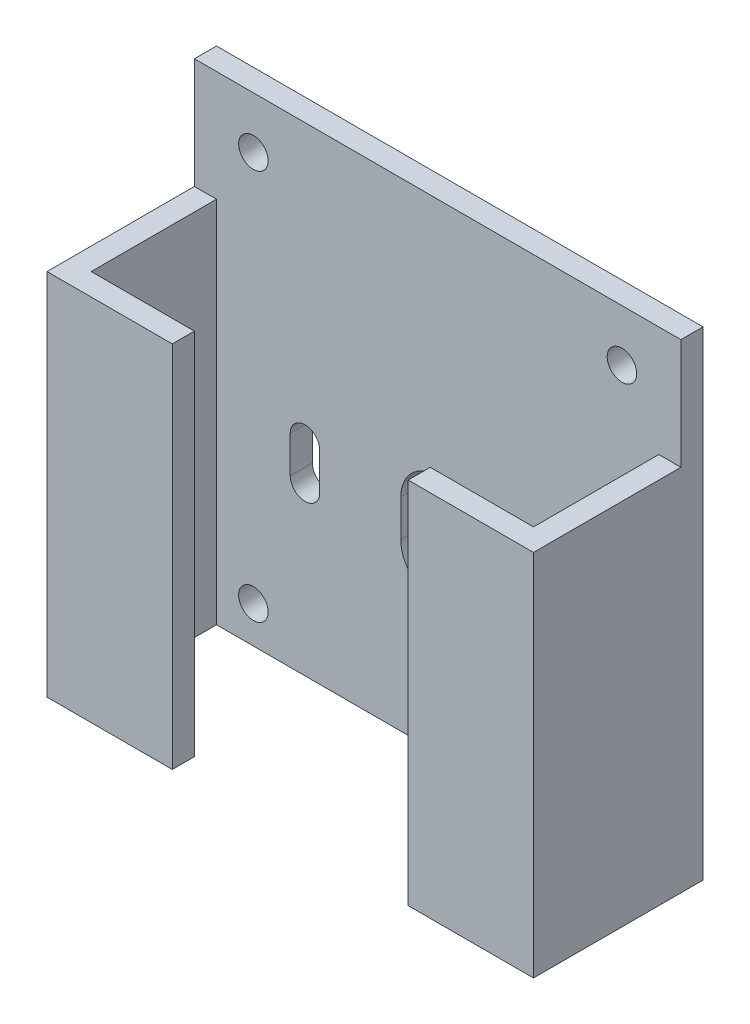
ISO-10303-21;
HEADER;
FILE_DESCRIPTION(('STEP AP214'),'2;1');
FILE_NAME('part.step','',(''),(''),'','','');
FILE_SCHEMA(('AUTOMOTIVE_DESIGN { 1 0 10303 214 1 1 1 1 }'));
ENDSEC;
DATA;
#1=APPLICATION_CONTEXT('core data for automotive mechanical design processes');
#2=APPLICATION_PROTOCOL_DEFINITION('international standard','automotive_design',2000,#1);
#3=PRODUCT_CONTEXT('',#1,'mechanical');
#4=PRODUCT('Part','Part','',(#3));
#5=PRODUCT_RELATED_PRODUCT_CATEGORY('part','',(#4));
#6=PRODUCT_DEFINITION_FORMATION('','',#4);
#7=PRODUCT_DEFINITION_CONTEXT('part definition',#1,'design');
#8=PRODUCT_DEFINITION('design','',#6,#7);
#9=PRODUCT_DEFINITION_SHAPE('','',#8);
#10=(LENGTH_UNIT() NAMED_UNIT(*) SI_UNIT(.MILLI.,.METRE.));
#11=(NAMED_UNIT(*) PLANE_ANGLE_UNIT() SI_UNIT($,.RADIAN.));
#12=(NAMED_UNIT(*) SI_UNIT($,.STERADIAN.) SOLID_ANGLE_UNIT());
#13=UNCERTAINTY_MEASURE_WITH_UNIT(LENGTH_MEASURE(1.E-05),#10,'distance_accuracy_value','');
#14=(GEOMETRIC_REPRESENTATION_CONTEXT(3) GLOBAL_UNCERTAINTY_ASSIGNED_CONTEXT((#13)) GLOBAL_UNIT_ASSIGNED_CONTEXT((#10,
#11,#12)) REPRESENTATION_CONTEXT('',''));
#15=CARTESIAN_POINT('',(0.,0.,0.));
#16=DIRECTION('',(0.,0.,1.));
#17=DIRECTION('',(1.,0.,0.));
#18=AXIS2_PLACEMENT_3D('',#15,#16,#17);
#19=CARTESIAN_POINT('',(-66.,-65.,23.));
#20=DIRECTION('',(0.,0.,1.));
#21=DIRECTION('',(1.,0.,0.));
#22=AXIS2_PLACEMENT_3D('',#19,#20,#21);
#23=PLANE('',#22);
#24=DIRECTION('',(1.,0.,0.));
#25=VECTOR('',#24,1.);
#26=CARTESIAN_POINT('',(-66.,-15.,23.));
#27=LINE('',#26,#25);
#28=CARTESIAN_POINT('',(-66.,-15.,23.));
#29=VERTEX_POINT('',#28);
#30=CARTESIAN_POINT('',(-49.,-15.,23.));
#31=VERTEX_POINT('',#30);
#32=EDGE_CURVE('E55',#29,#31,#27,.T.);
#33=ORIENTED_EDGE('',*,*,#32,.F.);
#34=DIRECTION('',(0.,-1.,0.));
#35=VECTOR('',#34,1.);
#36=CARTESIAN_POINT('',(-66.,-65.,23.));
#37=LINE('',#36,#35);
#38=CARTESIAN_POINT('',(-66.,-65.,23.));
#39=VERTEX_POINT('',#38);
#40=EDGE_CURVE('E217',#29,#39,#37,.T.);
#41=ORIENTED_EDGE('',*,*,#40,.T.);
#42=DIRECTION('',(1.,0.,0.));
#43=VECTOR('',#42,1.);
#44=CARTESIAN_POINT('',(-66.,-65.,23.));
#45=LINE('',#44,#43);
#46=CARTESIAN_POINT('',(-49.,-65.,23.));
#47=VERTEX_POINT('',#46);
#48=EDGE_CURVE('E254',#39,#47,#45,.T.);
#49=ORIENTED_EDGE('',*,*,#48,.T.);
#50=DIRECTION('',(0.,-1.,0.));
#51=VECTOR('',#50,1.);
#52=CARTESIAN_POINT('',(-49.,0.,23.));
#53=LINE('',#52,#51);
#54=EDGE_CURVE('E219',#31,#47,#53,.T.);
#55=ORIENTED_EDGE('',*,*,#54,.F.);
#56=EDGE_LOOP('',(#33,#41,#49,#55));
#57=FACE_BOUND('',#56,.T.);
#58=ADVANCED_FACE('F33',(#57),#23,.T.);
#59=CARTESIAN_POINT('',(-63.,-65.,20.));
#60=DIRECTION('',(0.,0.,1.));
#61=DIRECTION('',(1.,0.,0.));
#62=AXIS2_PLACEMENT_3D('',#59,#60,#61);
#63=PLANE('',#62);
#64=DIRECTION('',(0.,1.,0.));
#65=VECTOR('',#64,1.);
#66=CARTESIAN_POINT('',(-63.,-65.,20.));
#67=LINE('',#66,#65);
#68=CARTESIAN_POINT('',(-63.,-65.,20.));
#69=VERTEX_POINT('',#68);
#70=CARTESIAN_POINT('',(-63.,-15.,20.));
#71=VERTEX_POINT('',#70);
#72=EDGE_CURVE('E269',#69,#71,#67,.T.);
#73=ORIENTED_EDGE('',*,*,#72,.T.);
#74=DIRECTION('',(1.,0.,0.));
#75=VECTOR('',#74,1.);
#76=CARTESIAN_POINT('',(-63.,-15.,20.));
#77=LINE('',#76,#75);
#78=CARTESIAN_POINT('',(-49.,-15.,20.));
#79=VERTEX_POINT('',#78);
#80=EDGE_CURVE('E262',#71,#79,#77,.T.);
#81=ORIENTED_EDGE('',*,*,#80,.T.);
#82=DIRECTION('',(0.,1.,0.));
#83=VECTOR('',#82,1.);
#84=CARTESIAN_POINT('',(-49.,0.,20.));
#85=LINE('',#84,#83);
#86=CARTESIAN_POINT('',(-49.,-65.,20.));
#87=VERTEX_POINT('',#86);
#88=EDGE_CURVE('E260',#87,#79,#85,.T.);
#89=ORIENTED_EDGE('',*,*,#88,.F.);
#90=DIRECTION('',(1.,0.,0.));
#91=VECTOR('',#90,1.);
#92=CARTESIAN_POINT('',(-63.,-65.,20.));
#93=LINE('',#92,#91);
#94=EDGE_CURVE('E417',#69,#87,#93,.T.);
#95=ORIENTED_EDGE('',*,*,#94,.F.);
#96=EDGE_LOOP('',(#73,#81,#89,#95));
#97=FACE_BOUND('',#96,.T.);
#98=ADVANCED_FACE('F266',(#97),#63,.F.);
#99=CARTESIAN_POINT('',(-66.,0.,23.));
#100=DIRECTION('',(0.,1.,0.));
#101=DIRECTION('',(0.,0.,1.));
#102=AXIS2_PLACEMENT_3D('',#99,#100,#101);
#103=PLANE('',#102);
#104=DIRECTION('',(0.,0.,1.));
#105=VECTOR('',#104,1.);
#106=CARTESIAN_POINT('',(-66.,0.,23.));
#107=LINE('',#106,#105);
#108=CARTESIAN_POINT('',(-66.,0.,0.));
#109=VERTEX_POINT('',#108);
#110=CARTESIAN_POINT('',(-66.,0.,3.));
#111=VERTEX_POINT('',#110);
#112=EDGE_CURVE('E227',#109,#111,#107,.T.);
#113=ORIENTED_EDGE('',*,*,#112,.T.);
#114=DIRECTION('',(-1.,0.,0.));
#115=VECTOR('',#114,1.);
#116=CARTESIAN_POINT('',(-63.,0.,3.));
#117=LINE('',#116,#115);
#118=CARTESIAN_POINT('',(0.,0.,3.));
#119=VERTEX_POINT('',#118);
#120=EDGE_CURVE('E405',#119,#111,#117,.T.);
#121=ORIENTED_EDGE('',*,*,#120,.F.);
#122=DIRECTION('',(0.,0.,1.));
#123=VECTOR('',#122,1.);
#124=CARTESIAN_POINT('',(0.,0.,23.));
#125=LINE('',#124,#123);
#126=CARTESIAN_POINT('',(0.,0.,0.));
#127=VERTEX_POINT('',#126);
#128=EDGE_CURVE('E239',#127,#119,#125,.T.);
#129=ORIENTED_EDGE('',*,*,#128,.F.);
#130=DIRECTION('',(1.,0.,0.));
#131=VECTOR('',#130,1.);
#132=CARTESIAN_POINT('',(-66.,0.,0.));
#133=LINE('',#132,#131);
#134=EDGE_CURVE('E250',#109,#127,#133,.T.);
#135=ORIENTED_EDGE('',*,*,#134,.F.);
#136=EDGE_LOOP('',(#113,#121,#129,#135));
#137=FACE_BOUND('',#136,.T.);
#138=ADVANCED_FACE('F35',(#137),#103,.T.);
#139=CARTESIAN_POINT('',(-66.,0.,0.));
#140=DIRECTION('',(0.,0.,-1.));
#141=DIRECTION('',(-1.,0.,0.));
#142=AXIS2_PLACEMENT_3D('',#139,#140,#141);
#143=PLANE('',#142);
#144=CARTESIAN_POINT('',(-58.,-60.,0.));
#145=DIRECTION('',(0.,0.,-1.));
#146=DIRECTION('',(-1.,0.,0.));
#147=AXIS2_PLACEMENT_3D('',#144,#145,#146);
#148=CIRCLE('',#147,2.);
#149=CARTESIAN_POINT('',(-60.,-60.,0.));
#150=VERTEX_POINT('',#149);
#151=EDGE_CURVE('E383',#150,#150,#148,.T.);
#152=ORIENTED_EDGE('',*,*,#151,.F.);
#153=EDGE_LOOP('',(#152));
#154=FACE_BOUND('',#153,.T.);
#155=CARTESIAN_POINT('',(-8.,-60.,0.));
#156=DIRECTION('',(0.,0.,-1.));
#157=DIRECTION('',(-1.,0.,0.));
#158=AXIS2_PLACEMENT_3D('',#155,#156,#157);
#159=CIRCLE('',#158,2.);
#160=CARTESIAN_POINT('',(-10.,-60.,0.));
#161=VERTEX_POINT('',#160);
#162=EDGE_CURVE('E315',#161,#161,#159,.T.);
#163=ORIENTED_EDGE('',*,*,#162,.F.);
#164=EDGE_LOOP('',(#163));
#165=FACE_BOUND('',#164,.T.);
#166=CARTESIAN_POINT('',(-58.,-7.,0.));
#167=DIRECTION('',(0.,0.,-1.));
#168=DIRECTION('',(-1.,0.,0.));
#169=AXIS2_PLACEMENT_3D('',#166,#167,#168);
#170=CIRCLE('',#169,2.);
#171=CARTESIAN_POINT('',(-60.,-7.,0.));
#172=VERTEX_POINT('',#171);
#173=EDGE_CURVE('E346',#172,#172,#170,.T.);
#174=ORIENTED_EDGE('',*,*,#173,.F.);
#175=EDGE_LOOP('',(#174));
#176=FACE_BOUND('',#175,.T.);
#177=DIRECTION('',(0.,-1.,0.));
#178=VECTOR('',#177,1.);
#179=CARTESIAN_POINT('',(-13.,-37.5,0.));
#180=LINE('',#179,#178);
#181=CARTESIAN_POINT('',(-13.,-37.5,0.));
#182=VERTEX_POINT('',#181);
#183=CARTESIAN_POINT('',(-13.,-42.5,0.));
#184=VERTEX_POINT('',#183);
#185=EDGE_CURVE('E359',#182,#184,#180,.T.);
#186=ORIENTED_EDGE('',*,*,#185,.F.);
#187=CARTESIAN_POINT('',(-15.,-37.5,0.));
#188=DIRECTION('',(0.,0.,-1.));
#189=DIRECTION('',(-1.,0.,0.));
#190=AXIS2_PLACEMENT_3D('',#187,#188,#189);
#191=CIRCLE('',#190,2.);
#192=CARTESIAN_POINT('',(-17.,-37.5,0.));
#193=VERTEX_POINT('',#192);
#194=EDGE_CURVE('E362',#193,#182,#191,.T.);
#195=ORIENTED_EDGE('',*,*,#194,.F.);
#196=DIRECTION('',(0.,1.,0.));
#197=VECTOR('',#196,1.);
#198=CARTESIAN_POINT('',(-17.,-37.5,0.));
#199=LINE('',#198,#197);
#200=CARTESIAN_POINT('',(-17.,-42.5,0.));
#201=VERTEX_POINT('',#200);
#202=EDGE_CURVE('E353',#201,#193,#199,.T.);
#203=ORIENTED_EDGE('',*,*,#202,.F.);
#204=CARTESIAN_POINT('',(-15.,-42.5,0.));
#205=DIRECTION('',(0.,0.,-1.));
#206=DIRECTION('',(-1.,0.,0.));
#207=AXIS2_PLACEMENT_3D('',#204,#205,#206);
#208=CIRCLE('',#207,2.);
#209=EDGE_CURVE('E356',#184,#201,#208,.T.);
#210=ORIENTED_EDGE('',*,*,#209,.F.);
#211=EDGE_LOOP('',(#186,#195,#203,#210));
#212=FACE_BOUND('',#211,.T.);
#213=CARTESIAN_POINT('',(-33.,-37.5,0.));
#214=DIRECTION('',(0.,0.,-1.));
#215=DIRECTION('',(-1.,0.,0.));
#216=AXIS2_PLACEMENT_3D('',#213,#214,#215);
#217=CIRCLE('',#216,5.);
#218=CARTESIAN_POINT('',(-38.,-37.5,0.));
#219=VERTEX_POINT('',#218);
#220=CARTESIAN_POINT('',(-28.,-37.5,0.));
#221=VERTEX_POINT('',#220);
#222=EDGE_CURVE('E288',#219,#221,#217,.T.);
#223=ORIENTED_EDGE('',*,*,#222,.F.);
#224=DIRECTION('',(0.,1.,0.));
#225=VECTOR('',#224,1.);
#226=CARTESIAN_POINT('',(-38.,-37.5,0.));
#227=LINE('',#226,#225);
#228=CARTESIAN_POINT('',(-38.,-42.5,0.));
#229=VERTEX_POINT('',#228);
#230=EDGE_CURVE('E296',#229,#219,#227,.T.);
#231=ORIENTED_EDGE('',*,*,#230,.F.);
#232=CARTESIAN_POINT('',(-33.,-42.5,0.));
#233=DIRECTION('',(0.,0.,-1.));
#234=DIRECTION('',(-1.,0.,0.));
#235=AXIS2_PLACEMENT_3D('',#232,#233,#234);
#236=CIRCLE('',#235,5.);
#237=CARTESIAN_POINT('',(-28.,-42.5,0.));
#238=VERTEX_POINT('',#237);
#239=EDGE_CURVE('E293',#238,#229,#236,.T.);
#240=ORIENTED_EDGE('',*,*,#239,.F.);
#241=DIRECTION('',(0.,-1.,0.));
#242=VECTOR('',#241,1.);
#243=CARTESIAN_POINT('',(-28.,-37.5,0.));
#244=LINE('',#243,#242);
#245=EDGE_CURVE('E290',#221,#238,#244,.T.);
#246=ORIENTED_EDGE('',*,*,#245,.F.);
#247=EDGE_LOOP('',(#223,#231,#240,#246));
#248=FACE_BOUND('',#247,.T.);
#249=DIRECTION('',(0.,-1.,0.));
#250=VECTOR('',#249,1.);
#251=CARTESIAN_POINT('',(-49.,-37.5,0.));
#252=LINE('',#251,#250);
#253=CARTESIAN_POINT('',(-49.,-37.5,0.));
#254=VERTEX_POINT('',#253);
#255=CARTESIAN_POINT('',(-49.,-42.5,0.));
#256=VERTEX_POINT('',#255);
#257=EDGE_CURVE('E322',#254,#256,#252,.T.);
#258=ORIENTED_EDGE('',*,*,#257,.F.);
#259=CARTESIAN_POINT('',(-51.,-37.5,0.));
#260=DIRECTION('',(0.,0.,-1.));
#261=DIRECTION('',(-1.,0.,0.));
#262=AXIS2_PLACEMENT_3D('',#259,#260,#261);
#263=CIRCLE('',#262,2.00000000000001);
#264=CARTESIAN_POINT('',(-53.,-37.5,0.));
#265=VERTEX_POINT('',#264);
#266=EDGE_CURVE('E325',#265,#254,#263,.T.);
#267=ORIENTED_EDGE('',*,*,#266,.F.);
#268=DIRECTION('',(0.,1.,0.));
#269=VECTOR('',#268,1.);
#270=CARTESIAN_POINT('',(-53.,-37.5,0.));
#271=LINE('',#270,#269);
#272=CARTESIAN_POINT('',(-53.,-42.5,0.));
#273=VERTEX_POINT('',#272);
#274=EDGE_CURVE('E316',#273,#265,#271,.T.);
#275=ORIENTED_EDGE('',*,*,#274,.F.);
#276=CARTESIAN_POINT('',(-51.,-42.5,0.));
#277=DIRECTION('',(0.,0.,-1.));
#278=DIRECTION('',(-1.,0.,0.));
#279=AXIS2_PLACEMENT_3D('',#276,#277,#278);
#280=CIRCLE('',#279,2.);
#281=EDGE_CURVE('E319',#256,#273,#280,.T.);
#282=ORIENTED_EDGE('',*,*,#281,.F.);
#283=EDGE_LOOP('',(#258,#267,#275,#282));
#284=FACE_BOUND('',#283,.T.);
#285=CARTESIAN_POINT('',(-8.,-7.00000000000001,0.));
#286=DIRECTION('',(0.,0.,-1.));
#287=DIRECTION('',(-1.,0.,0.));
#288=AXIS2_PLACEMENT_3D('',#285,#286,#287);
#289=CIRCLE('',#288,2.);
#290=CARTESIAN_POINT('',(-10.,-7.00000000000001,0.));
#291=VERTEX_POINT('',#290);
#292=EDGE_CURVE('E392',#291,#291,#289,.T.);
#293=ORIENTED_EDGE('',*,*,#292,.F.);
#294=EDGE_LOOP('',(#293));
#295=FACE_BOUND('',#294,.T.);
#296=DIRECTION('',(0.,1.,0.));
#297=VECTOR('',#296,1.);
#298=CARTESIAN_POINT('',(0.,0.,0.));
#299=LINE('',#298,#297);
#300=CARTESIAN_POINT('',(0.,-65.,0.));
#301=VERTEX_POINT('',#300);
#302=EDGE_CURVE('E232',#301,#127,#299,.T.);
#303=ORIENTED_EDGE('',*,*,#302,.F.);
#304=DIRECTION('',(1.,0.,0.));
#305=VECTOR('',#304,1.);
#306=CARTESIAN_POINT('',(-66.,-65.,0.));
#307=LINE('',#306,#305);
#308=CARTESIAN_POINT('',(-66.,-65.,0.));
#309=VERTEX_POINT('',#308);
#310=EDGE_CURVE('E252',#309,#301,#307,.T.);
#311=ORIENTED_EDGE('',*,*,#310,.F.);
#312=DIRECTION('',(0.,1.,0.));
#313=VECTOR('',#312,1.);
#314=CARTESIAN_POINT('',(-66.,0.,0.));
#315=LINE('',#314,#313);
#316=EDGE_CURVE('E229',#309,#109,#315,.T.);
#317=ORIENTED_EDGE('',*,*,#316,.T.);
#318=ORIENTED_EDGE('',*,*,#134,.T.);
#319=EDGE_LOOP('',(#303,#311,#317,#318));
#320=FACE_BOUND('',#319,.T.);
#321=ADVANCED_FACE('F472',(#154,#165,#176,#212,#248,#284,#295,#320),#143,.T.);
#322=CARTESIAN_POINT('',(-66.,-65.,0.));
#323=DIRECTION('',(0.,-1.,0.));
#324=DIRECTION('',(0.,0.,-1.));
#325=AXIS2_PLACEMENT_3D('',#322,#323,#324);
#326=PLANE('',#325);
#327=DIRECTION('',(0.,0.,1.));
#328=VECTOR('',#327,1.);
#329=CARTESIAN_POINT('',(-49.,-65.,-0.001000000000001));
#330=LINE('',#329,#328);
#331=EDGE_CURVE('E402',#87,#47,#330,.T.);
#332=ORIENTED_EDGE('',*,*,#331,.T.);
#333=ORIENTED_EDGE('',*,*,#48,.F.);
#334=DIRECTION('',(0.,0.,-1.));
#335=VECTOR('',#334,1.);
#336=CARTESIAN_POINT('',(-66.,-65.,0.));
#337=LINE('',#336,#335);
#338=EDGE_CURVE('E226',#39,#309,#337,.T.);
#339=ORIENTED_EDGE('',*,*,#338,.T.);
#340=ORIENTED_EDGE('',*,*,#310,.T.);
#341=DIRECTION('',(0.,0.,-1.));
#342=VECTOR('',#341,1.);
#343=CARTESIAN_POINT('',(0.,-65.,0.));
#344=LINE('',#343,#342);
#345=CARTESIAN_POINT('',(0.,-65.,23.));
#346=VERTEX_POINT('',#345);
#347=EDGE_CURVE('E245',#346,#301,#344,.T.);
#348=ORIENTED_EDGE('',*,*,#347,.F.);
#349=CARTESIAN_POINT('',(-17.,-65.,23.));
#350=VERTEX_POINT('',#349);
#351=EDGE_CURVE('E238',#350,#346,#45,.T.);
#352=ORIENTED_EDGE('',*,*,#351,.F.);
#353=DIRECTION('',(0.,0.,1.));
#354=VECTOR('',#353,1.);
#355=CARTESIAN_POINT('',(-17.,-65.,-0.001000000000001));
#356=LINE('',#355,#354);
#357=CARTESIAN_POINT('',(-17.,-65.,20.));
#358=VERTEX_POINT('',#357);
#359=EDGE_CURVE('E403',#358,#350,#356,.T.);
#360=ORIENTED_EDGE('',*,*,#359,.F.);
#361=CARTESIAN_POINT('',(-3.,-65.,20.));
#362=VERTEX_POINT('',#361);
#363=EDGE_CURVE('E416',#358,#362,#93,.T.);
#364=ORIENTED_EDGE('',*,*,#363,.T.);
#365=DIRECTION('',(0.,0.,-1.));
#366=VECTOR('',#365,1.);
#367=CARTESIAN_POINT('',(-3.,-65.,20.));
#368=LINE('',#367,#366);
#369=CARTESIAN_POINT('',(-3.,-65.,3.));
#370=VERTEX_POINT('',#369);
#371=EDGE_CURVE('E407',#362,#370,#368,.T.);
#372=ORIENTED_EDGE('',*,*,#371,.T.);
#373=DIRECTION('',(-1.,0.,0.));
#374=VECTOR('',#373,1.);
#375=CARTESIAN_POINT('',(-63.,-65.,3.));
#376=LINE('',#375,#374);
#377=CARTESIAN_POINT('',(-63.,-65.,3.));
#378=VERTEX_POINT('',#377);
#379=EDGE_CURVE('E410',#370,#378,#376,.T.);
#380=ORIENTED_EDGE('',*,*,#379,.T.);
#381=DIRECTION('',(0.,0.,1.));
#382=VECTOR('',#381,1.);
#383=CARTESIAN_POINT('',(-63.,-65.,20.));
#384=LINE('',#383,#382);
#385=EDGE_CURVE('E413',#378,#69,#384,.T.);
#386=ORIENTED_EDGE('',*,*,#385,.T.);
#387=ORIENTED_EDGE('',*,*,#94,.T.);
#388=EDGE_LOOP('',(#332,#333,#339,#340,#348,#352,#360,#364,#372,#380,#386,#387));
#389=FACE_BOUND('',#388,.T.);
#390=ADVANCED_FACE('F450',(#389),#326,.T.);
#391=DIRECTION('',(1.,0.,0.));
#392=VECTOR('',#391,1.);
#393=CARTESIAN_POINT('',(-17.,-15.,23.));
#394=LINE('',#393,#392);
#395=CARTESIAN_POINT('',(-17.,-15.,23.));
#396=VERTEX_POINT('',#395);
#397=CARTESIAN_POINT('',(0.,-15.,23.));
#398=VERTEX_POINT('',#397);
#399=EDGE_CURVE('E457',#396,#398,#394,.T.);
#400=ORIENTED_EDGE('',*,*,#399,.F.);
#401=DIRECTION('',(0.,1.,0.));
#402=VECTOR('',#401,1.);
#403=CARTESIAN_POINT('',(-17.,0.,23.));
#404=LINE('',#403,#402);
#405=EDGE_CURVE('E399',#350,#396,#404,.T.);
#406=ORIENTED_EDGE('',*,*,#405,.F.);
#407=ORIENTED_EDGE('',*,*,#351,.T.);
#408=DIRECTION('',(0.,-1.,0.));
#409=VECTOR('',#408,1.);
#410=CARTESIAN_POINT('',(0.,-65.,23.));
#411=LINE('',#410,#409);
#412=EDGE_CURVE('E242',#398,#346,#411,.T.);
#413=ORIENTED_EDGE('',*,*,#412,.F.);
#414=EDGE_LOOP('',(#400,#406,#407,#413));
#415=FACE_BOUND('',#414,.T.);
#416=ADVANCED_FACE('F456',(#415),#23,.T.);
#417=CARTESIAN_POINT('',(-66.,0.,0.));
#418=DIRECTION('',(-1.,0.,0.));
#419=DIRECTION('',(0.,0.,1.));
#420=AXIS2_PLACEMENT_3D('',#417,#418,#419);
#421=PLANE('',#420);
#422=DIRECTION('',(0.,-1.,0.));
#423=VECTOR('',#422,1.);
#424=CARTESIAN_POINT('',(-66.,0.,3.));
#425=LINE('',#424,#423);
#426=CARTESIAN_POINT('',(-66.,-15.,3.));
#427=VERTEX_POINT('',#426);
#428=EDGE_CURVE('E212',#111,#427,#425,.T.);
#429=ORIENTED_EDGE('',*,*,#428,.F.);
#430=ORIENTED_EDGE('',*,*,#112,.F.);
#431=ORIENTED_EDGE('',*,*,#316,.F.);
#432=ORIENTED_EDGE('',*,*,#338,.F.);
#433=ORIENTED_EDGE('',*,*,#40,.F.);
#434=DIRECTION('',(0.,0.,1.));
#435=VECTOR('',#434,1.);
#436=CARTESIAN_POINT('',(-66.,-15.,-19.6715680975093));
#437=LINE('',#436,#435);
#438=EDGE_CURVE('E203',#427,#29,#437,.T.);
#439=ORIENTED_EDGE('',*,*,#438,.F.);
#440=EDGE_LOOP('',(#429,#430,#431,#432,#433,#439));
#441=FACE_BOUND('',#440,.T.);
#442=ADVANCED_FACE('F223',(#441),#421,.T.);
#443=CARTESIAN_POINT('',(0.,0.,0.));
#444=DIRECTION('',(-1.,0.,0.));
#445=DIRECTION('',(0.,0.,1.));
#446=AXIS2_PLACEMENT_3D('',#443,#444,#445);
#447=PLANE('',#446);
#448=ORIENTED_EDGE('',*,*,#128,.T.);
#449=DIRECTION('',(0.,1.,0.));
#450=VECTOR('',#449,1.);
#451=CARTESIAN_POINT('',(0.,0.,3.));
#452=LINE('',#451,#450);
#453=CARTESIAN_POINT('',(0.,-15.,3.));
#454=VERTEX_POINT('',#453);
#455=EDGE_CURVE('E220',#454,#119,#452,.T.);
#456=ORIENTED_EDGE('',*,*,#455,.F.);
#457=DIRECTION('',(0.,0.,1.));
#458=VECTOR('',#457,1.);
#459=CARTESIAN_POINT('',(0.,-15.,-19.6715680975093));
#460=LINE('',#459,#458);
#461=EDGE_CURVE('E460',#454,#398,#460,.T.);
#462=ORIENTED_EDGE('',*,*,#461,.T.);
#463=ORIENTED_EDGE('',*,*,#412,.T.);
#464=ORIENTED_EDGE('',*,*,#347,.T.);
#465=ORIENTED_EDGE('',*,*,#302,.T.);
#466=EDGE_LOOP('',(#448,#456,#462,#463,#464,#465));
#467=FACE_BOUND('',#466,.T.);
#468=ADVANCED_FACE('F466',(#467),#447,.F.);
#469=CARTESIAN_POINT('',(-3.,-65.,20.));
#470=DIRECTION('',(1.,0.,0.));
#471=DIRECTION('',(0.,0.,-1.));
#472=AXIS2_PLACEMENT_3D('',#469,#470,#471);
#473=PLANE('',#472);
#474=DIRECTION('',(0.,1.,0.));
#475=VECTOR('',#474,1.);
#476=CARTESIAN_POINT('',(-3.,-65.,20.));
#477=LINE('',#476,#475);
#478=CARTESIAN_POINT('',(-3.,-15.,20.));
#479=VERTEX_POINT('',#478);
#480=EDGE_CURVE('E243',#362,#479,#477,.T.);
#481=ORIENTED_EDGE('',*,*,#480,.T.);
#482=DIRECTION('',(0.,0.,-1.));
#483=VECTOR('',#482,1.);
#484=CARTESIAN_POINT('',(-3.,-15.,20.));
#485=LINE('',#484,#483);
#486=CARTESIAN_POINT('',(-3.,-15.,3.));
#487=VERTEX_POINT('',#486);
#488=EDGE_CURVE('E271',#479,#487,#485,.T.);
#489=ORIENTED_EDGE('',*,*,#488,.T.);
#490=DIRECTION('',(0.,1.,0.));
#491=VECTOR('',#490,1.);
#492=CARTESIAN_POINT('',(-3.,-65.,3.));
#493=LINE('',#492,#491);
#494=EDGE_CURVE('E419',#370,#487,#493,.T.);
#495=ORIENTED_EDGE('',*,*,#494,.F.);
#496=ORIENTED_EDGE('',*,*,#371,.F.);
#497=EDGE_LOOP('',(#481,#489,#495,#496));
#498=FACE_BOUND('',#497,.T.);
#499=ADVANCED_FACE('F437',(#498),#473,.F.);
#500=DIRECTION('',(0.,-1.,0.));
#501=VECTOR('',#500,1.);
#502=CARTESIAN_POINT('',(-17.,0.,20.));
#503=LINE('',#502,#501);
#504=CARTESIAN_POINT('',(-17.,-15.,20.));
#505=VERTEX_POINT('',#504);
#506=EDGE_CURVE('E395',#505,#358,#503,.T.);
#507=ORIENTED_EDGE('',*,*,#506,.F.);
#508=DIRECTION('',(1.,0.,0.));
#509=VECTOR('',#508,1.);
#510=CARTESIAN_POINT('',(-63.,-15.,20.));
#511=LINE('',#510,#509);
#512=EDGE_CURVE('E48',#505,#479,#511,.T.);
#513=ORIENTED_EDGE('',*,*,#512,.T.);
#514=ORIENTED_EDGE('',*,*,#480,.F.);
#515=ORIENTED_EDGE('',*,*,#363,.F.);
#516=EDGE_LOOP('',(#507,#513,#514,#515));
#517=FACE_BOUND('',#516,.T.);
#518=ADVANCED_FACE('F442',(#517),#63,.F.);
#519=CARTESIAN_POINT('',(-63.,-65.,20.));
#520=DIRECTION('',(-1.,0.,0.));
#521=DIRECTION('',(0.,0.,1.));
#522=AXIS2_PLACEMENT_3D('',#519,#520,#521);
#523=PLANE('',#522);
#524=DIRECTION('',(0.,1.,0.));
#525=VECTOR('',#524,1.);
#526=CARTESIAN_POINT('',(-63.,-65.,3.));
#527=LINE('',#526,#525);
#528=CARTESIAN_POINT('',(-63.,-15.,3.));
#529=VERTEX_POINT('',#528);
#530=EDGE_CURVE('E424',#378,#529,#527,.T.);
#531=ORIENTED_EDGE('',*,*,#530,.T.);
#532=DIRECTION('',(0.,0.,1.));
#533=VECTOR('',#532,1.);
#534=CARTESIAN_POINT('',(-63.,-15.,20.));
#535=LINE('',#534,#533);
#536=EDGE_CURVE('E211',#529,#71,#535,.T.);
#537=ORIENTED_EDGE('',*,*,#536,.T.);
#538=ORIENTED_EDGE('',*,*,#72,.F.);
#539=ORIENTED_EDGE('',*,*,#385,.F.);
#540=EDGE_LOOP('',(#531,#537,#538,#539));
#541=FACE_BOUND('',#540,.T.);
#542=ADVANCED_FACE('F474',(#541),#523,.F.);
#543=CARTESIAN_POINT('',(-63.,-65.,3.));
#544=DIRECTION('',(0.,0.,-1.));
#545=DIRECTION('',(-1.,0.,0.));
#546=AXIS2_PLACEMENT_3D('',#543,#544,#545);
#547=PLANE('',#546);
#548=ORIENTED_EDGE('',*,*,#120,.T.);
#549=ORIENTED_EDGE('',*,*,#428,.T.);
#550=DIRECTION('',(1.,0.,0.));
#551=VECTOR('',#550,1.);
#552=CARTESIAN_POINT('',(-66.,-15.,3.));
#553=LINE('',#552,#551);
#554=EDGE_CURVE('E206',#427,#529,#553,.T.);
#555=ORIENTED_EDGE('',*,*,#554,.T.);
#556=ORIENTED_EDGE('',*,*,#530,.F.);
#557=ORIENTED_EDGE('',*,*,#379,.F.);
#558=ORIENTED_EDGE('',*,*,#494,.T.);
#559=DIRECTION('',(1.,0.,0.));
#560=VECTOR('',#559,1.);
#561=CARTESIAN_POINT('',(-17.,-15.,3.));
#562=LINE('',#561,#560);
#563=EDGE_CURVE('E432',#487,#454,#562,.T.);
#564=ORIENTED_EDGE('',*,*,#563,.T.);
#565=ORIENTED_EDGE('',*,*,#455,.T.);
#566=EDGE_LOOP('',(#548,#549,#555,#556,#557,#558,#564,#565));
#567=FACE_BOUND('',#566,.T.);
#568=CARTESIAN_POINT('',(-58.,-60.,3.));
#569=DIRECTION('',(0.,0.,-1.));
#570=DIRECTION('',(-1.,0.,0.));
#571=AXIS2_PLACEMENT_3D('',#568,#569,#570);
#572=CIRCLE('',#571,2.);
#573=CARTESIAN_POINT('',(-60.,-60.,3.));
#574=VERTEX_POINT('',#573);
#575=EDGE_CURVE('E278',#574,#574,#572,.F.);
#576=ORIENTED_EDGE('',*,*,#575,.F.);
#577=EDGE_LOOP('',(#576));
#578=FACE_BOUND('',#577,.T.);
#579=CARTESIAN_POINT('',(-8.,-60.,3.));
#580=DIRECTION('',(0.,0.,-1.));
#581=DIRECTION('',(-1.,0.,0.));
#582=AXIS2_PLACEMENT_3D('',#579,#580,#581);
#583=CIRCLE('',#582,2.);
#584=CARTESIAN_POINT('',(-10.,-60.,3.));
#585=VERTEX_POINT('',#584);
#586=EDGE_CURVE('E380',#585,#585,#583,.F.);
#587=ORIENTED_EDGE('',*,*,#586,.F.);
#588=EDGE_LOOP('',(#587));
#589=FACE_BOUND('',#588,.T.);
#590=CARTESIAN_POINT('',(-15.,-37.5,3.));
#591=DIRECTION('',(0.,0.,-1.));
#592=DIRECTION('',(-1.,0.,0.));
#593=AXIS2_PLACEMENT_3D('',#590,#591,#592);
#594=CIRCLE('',#593,2.);
#595=CARTESIAN_POINT('',(-13.,-37.5,3.));
#596=VERTEX_POINT('',#595);
#597=CARTESIAN_POINT('',(-17.,-37.5,3.));
#598=VERTEX_POINT('',#597);
#599=EDGE_CURVE('E352',#596,#598,#594,.F.);
#600=ORIENTED_EDGE('',*,*,#599,.F.);
#601=DIRECTION('',(0.,1.,0.));
#602=VECTOR('',#601,1.);
#603=CARTESIAN_POINT('',(-13.,-37.5,3.));
#604=LINE('',#603,#602);
#605=CARTESIAN_POINT('',(-13.,-42.5,3.));
#606=VERTEX_POINT('',#605);
#607=EDGE_CURVE('E311',#606,#596,#604,.T.);
#608=ORIENTED_EDGE('',*,*,#607,.F.);
#609=CARTESIAN_POINT('',(-15.,-42.5,3.));
#610=DIRECTION('',(0.,0.,-1.));
#611=DIRECTION('',(-1.,0.,0.));
#612=AXIS2_PLACEMENT_3D('',#609,#610,#611);
#613=CIRCLE('',#612,2.);
#614=CARTESIAN_POINT('',(-17.,-42.5,3.));
#615=VERTEX_POINT('',#614);
#616=EDGE_CURVE('E365',#615,#606,#613,.F.);
#617=ORIENTED_EDGE('',*,*,#616,.F.);
#618=DIRECTION('',(0.,-1.,0.));
#619=VECTOR('',#618,1.);
#620=CARTESIAN_POINT('',(-17.,-37.5,3.));
#621=LINE('',#620,#619);
#622=EDGE_CURVE('E368',#598,#615,#621,.T.);
#623=ORIENTED_EDGE('',*,*,#622,.F.);
#624=EDGE_LOOP('',(#600,#608,#617,#623));
#625=FACE_BOUND('',#624,.T.);
#626=DIRECTION('',(0.,-1.,0.));
#627=VECTOR('',#626,1.);
#628=CARTESIAN_POINT('',(-38.,-37.5,3.));
#629=LINE('',#628,#627);
#630=CARTESIAN_POINT('',(-38.,-37.5,3.));
#631=VERTEX_POINT('',#630);
#632=CARTESIAN_POINT('',(-38.,-42.5,3.));
#633=VERTEX_POINT('',#632);
#634=EDGE_CURVE('E281',#631,#633,#629,.T.);
#635=ORIENTED_EDGE('',*,*,#634,.F.);
#636=CARTESIAN_POINT('',(-33.,-37.5,3.));
#637=DIRECTION('',(0.,0.,-1.));
#638=DIRECTION('',(-1.,0.,0.));
#639=AXIS2_PLACEMENT_3D('',#636,#637,#638);
#640=CIRCLE('',#639,5.);
#641=CARTESIAN_POINT('',(-28.,-37.5,3.));
#642=VERTEX_POINT('',#641);
#643=EDGE_CURVE('E285',#642,#631,#640,.F.);
#644=ORIENTED_EDGE('',*,*,#643,.F.);
#645=DIRECTION('',(0.,1.,0.));
#646=VECTOR('',#645,1.);
#647=CARTESIAN_POINT('',(-28.,-37.5,3.));
#648=LINE('',#647,#646);
#649=CARTESIAN_POINT('',(-28.,-42.5,3.));
#650=VERTEX_POINT('',#649);
#651=EDGE_CURVE('E302',#650,#642,#648,.T.);
#652=ORIENTED_EDGE('',*,*,#651,.F.);
#653=CARTESIAN_POINT('',(-33.,-42.5,3.));
#654=DIRECTION('',(0.,0.,-1.));
#655=DIRECTION('',(-1.,0.,0.));
#656=AXIS2_PLACEMENT_3D('',#653,#654,#655);
#657=CIRCLE('',#656,5.);
#658=EDGE_CURVE('E279',#633,#650,#657,.F.);
#659=ORIENTED_EDGE('',*,*,#658,.F.);
#660=EDGE_LOOP('',(#635,#644,#652,#659));
#661=FACE_BOUND('',#660,.T.);
#662=CARTESIAN_POINT('',(-51.,-37.5,3.));
#663=DIRECTION('',(0.,0.,-1.));
#664=DIRECTION('',(-1.,0.,0.));
#665=AXIS2_PLACEMENT_3D('',#662,#663,#664);
#666=CIRCLE('',#665,2.00000000000001);
#667=CARTESIAN_POINT('',(-49.,-37.5,3.));
#668=VERTEX_POINT('',#667);
#669=CARTESIAN_POINT('',(-53.,-37.5,3.));
#670=VERTEX_POINT('',#669);
#671=EDGE_CURVE('E314',#668,#670,#666,.F.);
#672=ORIENTED_EDGE('',*,*,#671,.F.);
#673=DIRECTION('',(0.,1.,0.));
#674=VECTOR('',#673,1.);
#675=CARTESIAN_POINT('',(-49.,-37.5,3.));
#676=LINE('',#675,#674);
#677=CARTESIAN_POINT('',(-49.,-42.5,3.));
#678=VERTEX_POINT('',#677);
#679=EDGE_CURVE('E312',#678,#668,#676,.T.);
#680=ORIENTED_EDGE('',*,*,#679,.F.);
#681=CARTESIAN_POINT('',(-51.,-42.5,3.));
#682=DIRECTION('',(0.,0.,-1.));
#683=DIRECTION('',(-1.,0.,0.));
#684=AXIS2_PLACEMENT_3D('',#681,#682,#683);
#685=CIRCLE('',#684,2.);
#686=CARTESIAN_POINT('',(-53.,-42.5,3.));
#687=VERTEX_POINT('',#686);
#688=EDGE_CURVE('E328',#687,#678,#685,.F.);
#689=ORIENTED_EDGE('',*,*,#688,.F.);
#690=DIRECTION('',(0.,-1.,0.));
#691=VECTOR('',#690,1.);
#692=CARTESIAN_POINT('',(-53.,-37.5,3.));
#693=LINE('',#692,#691);
#694=EDGE_CURVE('E331',#670,#687,#693,.T.);
#695=ORIENTED_EDGE('',*,*,#694,.F.);
#696=EDGE_LOOP('',(#672,#680,#689,#695));
#697=FACE_BOUND('',#696,.T.);
#698=CARTESIAN_POINT('',(-8.,-7.00000000000001,3.));
#699=DIRECTION('',(0.,0.,-1.));
#700=DIRECTION('',(-1.,0.,0.));
#701=AXIS2_PLACEMENT_3D('',#698,#699,#700);
#702=CIRCLE('',#701,2.);
#703=CARTESIAN_POINT('',(-10.,-7.00000000000001,3.));
#704=VERTEX_POINT('',#703);
#705=EDGE_CURVE('E350',#704,#704,#702,.F.);
#706=ORIENTED_EDGE('',*,*,#705,.F.);
#707=EDGE_LOOP('',(#706));
#708=FACE_BOUND('',#707,.T.);
#709=CARTESIAN_POINT('',(-58.,-7.,3.));
#710=DIRECTION('',(0.,0.,-1.));
#711=DIRECTION('',(-1.,0.,0.));
#712=AXIS2_PLACEMENT_3D('',#709,#710,#711);
#713=CIRCLE('',#712,2.);
#714=CARTESIAN_POINT('',(-60.,-7.,3.));
#715=VERTEX_POINT('',#714);
#716=EDGE_CURVE('E343',#715,#715,#713,.F.);
#717=ORIENTED_EDGE('',*,*,#716,.F.);
#718=EDGE_LOOP('',(#717));
#719=FACE_BOUND('',#718,.T.);
#720=ADVANCED_FACE('F429',(#567,#578,#589,#625,#661,#697,#708,#719),#547,.F.);
#721=CARTESIAN_POINT('',(-17.,0.,-0.001000000000001));
#722=DIRECTION('',(1.,0.,0.));
#723=DIRECTION('',(0.,1.,0.));
#724=AXIS2_PLACEMENT_3D('',#721,#722,#723);
#725=PLANE('',#724);
#726=ORIENTED_EDGE('',*,*,#405,.T.);
#727=DIRECTION('',(0.,0.,-1.));
#728=VECTOR('',#727,1.);
#729=CARTESIAN_POINT('',(-17.,-15.,-0.001000000000001));
#730=LINE('',#729,#728);
#731=EDGE_CURVE('E11',#396,#505,#730,.T.);
#732=ORIENTED_EDGE('',*,*,#731,.T.);
#733=ORIENTED_EDGE('',*,*,#506,.T.);
#734=ORIENTED_EDGE('',*,*,#359,.T.);
#735=EDGE_LOOP('',(#726,#732,#733,#734));
#736=FACE_BOUND('',#735,.T.);
#737=ADVANCED_FACE('F446',(#736),#725,.F.);
#738=CARTESIAN_POINT('',(-49.,0.,-0.001000000000001));
#739=DIRECTION('',(-1.,0.,0.));
#740=DIRECTION('',(0.,-1.,0.));
#741=AXIS2_PLACEMENT_3D('',#738,#739,#740);
#742=PLANE('',#741);
#743=ORIENTED_EDGE('',*,*,#88,.T.);
#744=DIRECTION('',(0.,0.,1.));
#745=VECTOR('',#744,1.);
#746=CARTESIAN_POINT('',(-49.,-15.,-0.001000000000001));
#747=LINE('',#746,#745);
#748=EDGE_CURVE('E41',#79,#31,#747,.T.);
#749=ORIENTED_EDGE('',*,*,#748,.T.);
#750=ORIENTED_EDGE('',*,*,#54,.T.);
#751=ORIENTED_EDGE('',*,*,#331,.F.);
#752=EDGE_LOOP('',(#743,#749,#750,#751));
#753=FACE_BOUND('',#752,.T.);
#754=ADVANCED_FACE('F257',(#753),#742,.F.);
#755=CARTESIAN_POINT('',(-8.,-7.00000000000001,23.001));
#756=DIRECTION('',(0.,0.,-1.));
#757=DIRECTION('',(-1.,0.,0.));
#758=AXIS2_PLACEMENT_3D('',#755,#756,#757);
#759=CYLINDRICAL_SURFACE('',#758,2.);
#760=ORIENTED_EDGE('',*,*,#292,.T.);
#761=EDGE_LOOP('',(#760));
#762=FACE_BOUND('',#761,.T.);
#763=ORIENTED_EDGE('',*,*,#705,.T.);
#764=EDGE_LOOP('',(#763));
#765=FACE_BOUND('',#764,.T.);
#766=ADVANCED_FACE('F543',(#762,#765),#759,.F.);
#767=CARTESIAN_POINT('',(-49.,-37.5,23.001));
#768=DIRECTION('',(1.,0.,0.));
#769=DIRECTION('',(0.,1.,0.));
#770=AXIS2_PLACEMENT_3D('',#767,#768,#769);
#771=PLANE('',#770);
#772=ORIENTED_EDGE('',*,*,#679,.T.);
#773=DIRECTION('',(0.,0.,-1.));
#774=VECTOR('',#773,1.);
#775=CARTESIAN_POINT('',(-49.,-37.5,23.001));
#776=LINE('',#775,#774);
#777=EDGE_CURVE('E282',#668,#254,#776,.T.);
#778=ORIENTED_EDGE('',*,*,#777,.T.);
#779=ORIENTED_EDGE('',*,*,#257,.T.);
#780=DIRECTION('',(0.,0.,-1.));
#781=VECTOR('',#780,1.);
#782=CARTESIAN_POINT('',(-49.,-42.5,23.001));
#783=LINE('',#782,#781);
#784=EDGE_CURVE('E318',#678,#256,#783,.T.);
#785=ORIENTED_EDGE('',*,*,#784,.F.);
#786=EDGE_LOOP('',(#772,#778,#779,#785));
#787=FACE_BOUND('',#786,.T.);
#788=ADVANCED_FACE('F595',(#787),#771,.F.);
#789=CARTESIAN_POINT('',(-51.,-42.5,23.001));
#790=DIRECTION('',(0.,0.,-1.));
#791=DIRECTION('',(-1.,0.,0.));
#792=AXIS2_PLACEMENT_3D('',#789,#790,#791);
#793=CYLINDRICAL_SURFACE('',#792,2.);
#794=ORIENTED_EDGE('',*,*,#688,.T.);
#795=ORIENTED_EDGE('',*,*,#784,.T.);
#796=ORIENTED_EDGE('',*,*,#281,.T.);
#797=DIRECTION('',(0.,0.,-1.));
#798=VECTOR('',#797,1.);
#799=CARTESIAN_POINT('',(-53.,-42.5,23.001));
#800=LINE('',#799,#798);
#801=EDGE_CURVE('E339',#687,#273,#800,.T.);
#802=ORIENTED_EDGE('',*,*,#801,.F.);
#803=EDGE_LOOP('',(#794,#795,#796,#802));
#804=FACE_BOUND('',#803,.T.);
#805=ADVANCED_FACE('F591',(#804),#793,.F.);
#806=CARTESIAN_POINT('',(-53.,-37.5,23.001));
#807=DIRECTION('',(-1.,0.,0.));
#808=DIRECTION('',(0.,-1.,0.));
#809=AXIS2_PLACEMENT_3D('',#806,#807,#808);
#810=PLANE('',#809);
#811=ORIENTED_EDGE('',*,*,#694,.T.);
#812=ORIENTED_EDGE('',*,*,#801,.T.);
#813=ORIENTED_EDGE('',*,*,#274,.T.);
#814=DIRECTION('',(0.,0.,-1.));
#815=VECTOR('',#814,1.);
#816=CARTESIAN_POINT('',(-53.,-37.5,23.001));
#817=LINE('',#816,#815);
#818=EDGE_CURVE('E336',#670,#265,#817,.T.);
#819=ORIENTED_EDGE('',*,*,#818,.F.);
#820=EDGE_LOOP('',(#811,#812,#813,#819));
#821=FACE_BOUND('',#820,.T.);
#822=ADVANCED_FACE('F587',(#821),#810,.F.);
#823=CARTESIAN_POINT('',(-51.,-37.5,23.001));
#824=DIRECTION('',(0.,0.,-1.));
#825=DIRECTION('',(-1.,0.,0.));
#826=AXIS2_PLACEMENT_3D('',#823,#824,#825);
#827=CYLINDRICAL_SURFACE('',#826,2.00000000000001);
#828=ORIENTED_EDGE('',*,*,#671,.T.);
#829=ORIENTED_EDGE('',*,*,#818,.T.);
#830=ORIENTED_EDGE('',*,*,#266,.T.);
#831=ORIENTED_EDGE('',*,*,#777,.F.);
#832=EDGE_LOOP('',(#828,#829,#830,#831));
#833=FACE_BOUND('',#832,.T.);
#834=ADVANCED_FACE('F583',(#833),#827,.F.);
#835=CARTESIAN_POINT('',(-33.,-37.5,23.001));
#836=DIRECTION('',(0.,0.,-1.));
#837=DIRECTION('',(-1.,0.,0.));
#838=AXIS2_PLACEMENT_3D('',#835,#836,#837);
#839=CYLINDRICAL_SURFACE('',#838,5.);
#840=ORIENTED_EDGE('',*,*,#643,.T.);
#841=DIRECTION('',(0.,0.,-1.));
#842=VECTOR('',#841,1.);
#843=CARTESIAN_POINT('',(-38.,-37.5,23.001));
#844=LINE('',#843,#842);
#845=EDGE_CURVE('E300',#631,#219,#844,.T.);
#846=ORIENTED_EDGE('',*,*,#845,.T.);
#847=ORIENTED_EDGE('',*,*,#222,.T.);
#848=DIRECTION('',(0.,0.,-1.));
#849=VECTOR('',#848,1.);
#850=CARTESIAN_POINT('',(-28.,-37.5,23.001));
#851=LINE('',#850,#849);
#852=EDGE_CURVE('E299',#642,#221,#851,.T.);
#853=ORIENTED_EDGE('',*,*,#852,.F.);
#854=EDGE_LOOP('',(#840,#846,#847,#853));
#855=FACE_BOUND('',#854,.T.);
#856=ADVANCED_FACE('F571',(#855),#839,.F.);
#857=CARTESIAN_POINT('',(-38.,-37.5,23.001));
#858=DIRECTION('',(-1.,0.,0.));
#859=DIRECTION('',(0.,-1.,0.));
#860=AXIS2_PLACEMENT_3D('',#857,#858,#859);
#861=PLANE('',#860);
#862=ORIENTED_EDGE('',*,*,#634,.T.);
#863=DIRECTION('',(0.,0.,-1.));
#864=VECTOR('',#863,1.);
#865=CARTESIAN_POINT('',(-38.,-42.5,23.001));
#866=LINE('',#865,#864);
#867=EDGE_CURVE('E303',#633,#229,#866,.T.);
#868=ORIENTED_EDGE('',*,*,#867,.T.);
#869=ORIENTED_EDGE('',*,*,#230,.T.);
#870=ORIENTED_EDGE('',*,*,#845,.F.);
#871=EDGE_LOOP('',(#862,#868,#869,#870));
#872=FACE_BOUND('',#871,.T.);
#873=ADVANCED_FACE('F567',(#872),#861,.F.);
#874=CARTESIAN_POINT('',(-33.,-42.5,23.001));
#875=DIRECTION('',(0.,0.,-1.));
#876=DIRECTION('',(-1.,0.,0.));
#877=AXIS2_PLACEMENT_3D('',#874,#875,#876);
#878=CYLINDRICAL_SURFACE('',#877,5.);
#879=ORIENTED_EDGE('',*,*,#658,.T.);
#880=DIRECTION('',(0.,0.,-1.));
#881=VECTOR('',#880,1.);
#882=CARTESIAN_POINT('',(-28.,-42.5,23.001));
#883=LINE('',#882,#881);
#884=EDGE_CURVE('E305',#650,#238,#883,.T.);
#885=ORIENTED_EDGE('',*,*,#884,.T.);
#886=ORIENTED_EDGE('',*,*,#239,.T.);
#887=ORIENTED_EDGE('',*,*,#867,.F.);
#888=EDGE_LOOP('',(#879,#885,#886,#887));
#889=FACE_BOUND('',#888,.T.);
#890=ADVANCED_FACE('F570',(#889),#878,.F.);
#891=CARTESIAN_POINT('',(-28.,-37.5,23.001));
#892=DIRECTION('',(1.,0.,0.));
#893=DIRECTION('',(0.,0.,-1.));
#894=AXIS2_PLACEMENT_3D('',#891,#892,#893);
#895=PLANE('',#894);
#896=ORIENTED_EDGE('',*,*,#651,.T.);
#897=ORIENTED_EDGE('',*,*,#852,.T.);
#898=ORIENTED_EDGE('',*,*,#245,.T.);
#899=ORIENTED_EDGE('',*,*,#884,.F.);
#900=EDGE_LOOP('',(#896,#897,#898,#899));
#901=FACE_BOUND('',#900,.T.);
#902=ADVANCED_FACE('F575',(#901),#895,.F.);
#903=CARTESIAN_POINT('',(-13.,-37.5,23.001));
#904=DIRECTION('',(1.,0.,0.));
#905=DIRECTION('',(0.,0.,-1.));
#906=AXIS2_PLACEMENT_3D('',#903,#904,#905);
#907=PLANE('',#906);
#908=ORIENTED_EDGE('',*,*,#607,.T.);
#909=DIRECTION('',(0.,0.,-1.));
#910=VECTOR('',#909,1.);
#911=CARTESIAN_POINT('',(-13.,-37.5,23.001));
#912=LINE('',#911,#910);
#913=EDGE_CURVE('E347',#596,#182,#912,.T.);
#914=ORIENTED_EDGE('',*,*,#913,.T.);
#915=ORIENTED_EDGE('',*,*,#185,.T.);
#916=DIRECTION('',(0.,0.,-1.));
#917=VECTOR('',#916,1.);
#918=CARTESIAN_POINT('',(-13.,-42.5,23.001));
#919=LINE('',#918,#917);
#920=EDGE_CURVE('E355',#606,#184,#919,.T.);
#921=ORIENTED_EDGE('',*,*,#920,.F.);
#922=EDGE_LOOP('',(#908,#914,#915,#921));
#923=FACE_BOUND('',#922,.T.);
#924=ADVANCED_FACE('F579',(#923),#907,.F.);
#925=CARTESIAN_POINT('',(-15.,-42.5,23.001));
#926=DIRECTION('',(0.,0.,-1.));
#927=DIRECTION('',(-1.,0.,0.));
#928=AXIS2_PLACEMENT_3D('',#925,#926,#927);
#929=CYLINDRICAL_SURFACE('',#928,2.);
#930=ORIENTED_EDGE('',*,*,#616,.T.);
#931=ORIENTED_EDGE('',*,*,#920,.T.);
#932=ORIENTED_EDGE('',*,*,#209,.T.);
#933=DIRECTION('',(0.,0.,-1.));
#934=VECTOR('',#933,1.);
#935=CARTESIAN_POINT('',(-17.,-42.5,23.001));
#936=LINE('',#935,#934);
#937=EDGE_CURVE('E376',#615,#201,#936,.T.);
#938=ORIENTED_EDGE('',*,*,#937,.F.);
#939=EDGE_LOOP('',(#930,#931,#932,#938));
#940=FACE_BOUND('',#939,.T.);
#941=ADVANCED_FACE('F612',(#940),#929,.F.);
#942=CARTESIAN_POINT('',(-17.,-37.5,23.001));
#943=DIRECTION('',(-1.,0.,0.));
#944=DIRECTION('',(0.,0.,1.));
#945=AXIS2_PLACEMENT_3D('',#942,#943,#944);
#946=PLANE('',#945);
#947=ORIENTED_EDGE('',*,*,#622,.T.);
#948=ORIENTED_EDGE('',*,*,#937,.T.);
#949=ORIENTED_EDGE('',*,*,#202,.T.);
#950=DIRECTION('',(0.,0.,-1.));
#951=VECTOR('',#950,1.);
#952=CARTESIAN_POINT('',(-17.,-37.5,23.001));
#953=LINE('',#952,#951);
#954=EDGE_CURVE('E373',#598,#193,#953,.T.);
#955=ORIENTED_EDGE('',*,*,#954,.F.);
#956=EDGE_LOOP('',(#947,#948,#949,#955));
#957=FACE_BOUND('',#956,.T.);
#958=ADVANCED_FACE('F608',(#957),#946,.F.);
#959=CARTESIAN_POINT('',(-15.,-37.5,23.001));
#960=DIRECTION('',(0.,0.,-1.));
#961=DIRECTION('',(-1.,0.,0.));
#962=AXIS2_PLACEMENT_3D('',#959,#960,#961);
#963=CYLINDRICAL_SURFACE('',#962,2.);
#964=ORIENTED_EDGE('',*,*,#599,.T.);
#965=ORIENTED_EDGE('',*,*,#954,.T.);
#966=ORIENTED_EDGE('',*,*,#194,.T.);
#967=ORIENTED_EDGE('',*,*,#913,.F.);
#968=EDGE_LOOP('',(#964,#965,#966,#967));
#969=FACE_BOUND('',#968,.T.);
#970=ADVANCED_FACE('F604',(#969),#963,.F.);
#971=CARTESIAN_POINT('',(-58.,-7.,23.001));
#972=DIRECTION('',(0.,0.,-1.));
#973=DIRECTION('',(-1.,0.,0.));
#974=AXIS2_PLACEMENT_3D('',#971,#972,#973);
#975=CYLINDRICAL_SURFACE('',#974,2.);
#976=ORIENTED_EDGE('',*,*,#173,.T.);
#977=EDGE_LOOP('',(#976));
#978=FACE_BOUND('',#977,.T.);
#979=ORIENTED_EDGE('',*,*,#716,.T.);
#980=EDGE_LOOP('',(#979));
#981=FACE_BOUND('',#980,.T.);
#982=ADVANCED_FACE('F600',(#978,#981),#975,.F.);
#983=CARTESIAN_POINT('',(-8.,-60.,23.001));
#984=DIRECTION('',(0.,0.,-1.));
#985=DIRECTION('',(-1.,0.,0.));
#986=AXIS2_PLACEMENT_3D('',#983,#984,#985);
#987=CYLINDRICAL_SURFACE('',#986,2.);
#988=ORIENTED_EDGE('',*,*,#162,.T.);
#989=EDGE_LOOP('',(#988));
#990=FACE_BOUND('',#989,.T.);
#991=ORIENTED_EDGE('',*,*,#586,.T.);
#992=EDGE_LOOP('',(#991));
#993=FACE_BOUND('',#992,.T.);
#994=ADVANCED_FACE('F603',(#990,#993),#987,.F.);
#995=CARTESIAN_POINT('',(-58.,-60.,23.001));
#996=DIRECTION('',(0.,0.,-1.));
#997=DIRECTION('',(-1.,0.,0.));
#998=AXIS2_PLACEMENT_3D('',#995,#996,#997);
#999=CYLINDRICAL_SURFACE('',#998,2.);
#1000=ORIENTED_EDGE('',*,*,#151,.T.);
#1001=EDGE_LOOP('',(#1000));
#1002=FACE_BOUND('',#1001,.T.);
#1003=ORIENTED_EDGE('',*,*,#575,.T.);
#1004=EDGE_LOOP('',(#1003));
#1005=FACE_BOUND('',#1004,.T.);
#1006=ADVANCED_FACE('F553',(#1002,#1005),#999,.F.);
#1007=CARTESIAN_POINT('',(-66.,-15.,-19.6715680975093));
#1008=DIRECTION('',(0.,-1.,0.));
#1009=DIRECTION('',(0.,0.,-1.));
#1010=AXIS2_PLACEMENT_3D('',#1007,#1008,#1009);
#1011=PLANE('',#1010);
#1012=ORIENTED_EDGE('',*,*,#536,.F.);
#1013=ORIENTED_EDGE('',*,*,#554,.F.);
#1014=ORIENTED_EDGE('',*,*,#438,.T.);
#1015=ORIENTED_EDGE('',*,*,#32,.T.);
#1016=ORIENTED_EDGE('',*,*,#748,.F.);
#1017=ORIENTED_EDGE('',*,*,#80,.F.);
#1018=EDGE_LOOP('',(#1012,#1013,#1014,#1015,#1016,#1017));
#1019=FACE_BOUND('',#1018,.T.);
#1020=ADVANCED_FACE('F204',(#1019),#1011,.F.);
#1021=CARTESIAN_POINT('',(-17.,-15.,-19.6715680975093));
#1022=DIRECTION('',(0.,-1.,0.));
#1023=DIRECTION('',(0.,0.,-1.));
#1024=AXIS2_PLACEMENT_3D('',#1021,#1022,#1023);
#1025=PLANE('',#1024);
#1026=ORIENTED_EDGE('',*,*,#512,.F.);
#1027=ORIENTED_EDGE('',*,*,#731,.F.);
#1028=ORIENTED_EDGE('',*,*,#399,.T.);
#1029=ORIENTED_EDGE('',*,*,#461,.F.);
#1030=ORIENTED_EDGE('',*,*,#563,.F.);
#1031=ORIENTED_EDGE('',*,*,#488,.F.);
#1032=EDGE_LOOP('',(#1026,#1027,#1028,#1029,#1030,#1031));
#1033=FACE_BOUND('',#1032,.T.);
#1034=ADVANCED_FACE('F439',(#1033),#1025,.F.);
#1035=CLOSED_SHELL('',(#58,#98,#138,#321,#390,#416,#442,#468,#499,#518,#542,#720,#737,#754,#766,
#788,#805,#822,#834,#856,#873,#890,#902,#924,#941,#958,#970,#982,#994,#1006,#1020,#1034));
#1036=MANIFOLD_SOLID_BREP('B2',#1035);
#1037=ADVANCED_BREP_SHAPE_REPRESENTATION('',(#18,#1036),#14);
#1038=SHAPE_DEFINITION_REPRESENTATION(#9,#1037);
ENDSEC;
END-ISO-10303-21;
